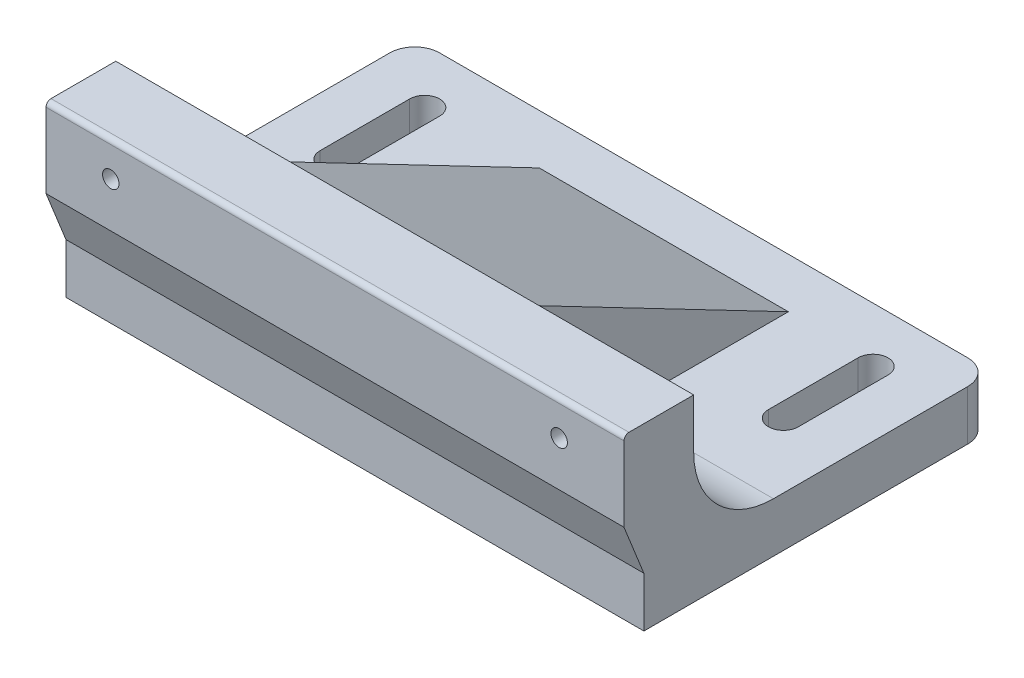
ISO-10303-21;
HEADER;
FILE_DESCRIPTION(('STEP AP214'),'2;1');
FILE_NAME('part.step','',(''),(''),'','','');
FILE_SCHEMA(('AUTOMOTIVE_DESIGN { 1 0 10303 214 1 1 1 1 }'));
ENDSEC;
DATA;
#1=APPLICATION_CONTEXT('core data for automotive mechanical design processes');
#2=APPLICATION_PROTOCOL_DEFINITION('international standard','automotive_design',2000,#1);
#3=PRODUCT_CONTEXT('',#1,'mechanical');
#4=PRODUCT('Part','Part','',(#3));
#5=PRODUCT_RELATED_PRODUCT_CATEGORY('part','',(#4));
#6=PRODUCT_DEFINITION_FORMATION('','',#4);
#7=PRODUCT_DEFINITION_CONTEXT('part definition',#1,'design');
#8=PRODUCT_DEFINITION('design','',#6,#7);
#9=PRODUCT_DEFINITION_SHAPE('','',#8);
#10=(LENGTH_UNIT() NAMED_UNIT(*) SI_UNIT(.MILLI.,.METRE.));
#11=(NAMED_UNIT(*) PLANE_ANGLE_UNIT() SI_UNIT($,.RADIAN.));
#12=(NAMED_UNIT(*) SI_UNIT($,.STERADIAN.) SOLID_ANGLE_UNIT());
#13=UNCERTAINTY_MEASURE_WITH_UNIT(LENGTH_MEASURE(1.E-05),#10,'distance_accuracy_value','');
#14=(GEOMETRIC_REPRESENTATION_CONTEXT(3) GLOBAL_UNCERTAINTY_ASSIGNED_CONTEXT((#13)) GLOBAL_UNIT_ASSIGNED_CONTEXT((#10,
#11,#12)) REPRESENTATION_CONTEXT('',''));
#15=CARTESIAN_POINT('',(0.,0.,0.));
#16=DIRECTION('',(0.,0.,1.));
#17=DIRECTION('',(1.,0.,0.));
#18=AXIS2_PLACEMENT_3D('',#15,#16,#17);
#19=CARTESIAN_POINT('',(103.,29.05,-70.));
#20=DIRECTION('',(0.,0.,1.));
#21=DIRECTION('',(1.,0.,0.));
#22=AXIS2_PLACEMENT_3D('',#19,#20,#21);
#23=CYLINDRICAL_SURFACE('',#22,1.65);
#24=CARTESIAN_POINT('',(103.,29.05,4.));
#25=DIRECTION('',(0.,0.,1.));
#26=DIRECTION('',(1.,0.,0.));
#27=AXIS2_PLACEMENT_3D('',#24,#25,#26);
#28=CIRCLE('',#27,1.65);
#29=CARTESIAN_POINT('',(104.65,29.05,4.));
#30=VERTEX_POINT('',#29);
#31=EDGE_CURVE('E404',#30,#30,#28,.T.);
#32=ORIENTED_EDGE('',*,*,#31,.T.);
#33=EDGE_LOOP('',(#32));
#34=FACE_BOUND('',#33,.T.);
#35=CARTESIAN_POINT('',(103.,29.05,-5.));
#36=DIRECTION('',(0.,0.,-1.));
#37=DIRECTION('',(-1.,0.,0.));
#38=AXIS2_PLACEMENT_3D('',#35,#36,#37);
#39=CIRCLE('',#38,1.65);
#40=CARTESIAN_POINT('',(101.35,29.05,-5.));
#41=VERTEX_POINT('',#40);
#42=EDGE_CURVE('E50',#41,#41,#39,.F.);
#43=ORIENTED_EDGE('',*,*,#42,.F.);
#44=EDGE_LOOP('',(#43));
#45=FACE_BOUND('',#44,.T.);
#46=ADVANCED_FACE('F46',(#34,#45),#23,.F.);
#47=CARTESIAN_POINT('',(13.,29.05,-70.));
#48=DIRECTION('',(0.,0.,1.));
#49=DIRECTION('',(1.,0.,0.));
#50=AXIS2_PLACEMENT_3D('',#47,#48,#49);
#51=CYLINDRICAL_SURFACE('',#50,1.65);
#52=CARTESIAN_POINT('',(13.,29.05,4.));
#53=DIRECTION('',(0.,0.,1.));
#54=DIRECTION('',(1.,0.,0.));
#55=AXIS2_PLACEMENT_3D('',#52,#53,#54);
#56=CIRCLE('',#55,1.65);
#57=CARTESIAN_POINT('',(14.65,29.05,4.));
#58=VERTEX_POINT('',#57);
#59=EDGE_CURVE('E234',#58,#58,#56,.T.);
#60=ORIENTED_EDGE('',*,*,#59,.T.);
#61=EDGE_LOOP('',(#60));
#62=FACE_BOUND('',#61,.T.);
#63=CARTESIAN_POINT('',(13.,29.05,-5.));
#64=DIRECTION('',(0.,0.,-1.));
#65=DIRECTION('',(-1.,0.,0.));
#66=AXIS2_PLACEMENT_3D('',#63,#64,#65);
#67=CIRCLE('',#66,1.65);
#68=CARTESIAN_POINT('',(11.35,29.05,-5.));
#69=VERTEX_POINT('',#68);
#70=EDGE_CURVE('E398',#69,#69,#67,.F.);
#71=ORIENTED_EDGE('',*,*,#70,.F.);
#72=EDGE_LOOP('',(#71));
#73=FACE_BOUND('',#72,.T.);
#74=ADVANCED_FACE('F445',(#62,#73),#51,.F.);
#75=CARTESIAN_POINT('',(0.,10.,0.));
#76=DIRECTION('',(0.,-1.,0.));
#77=DIRECTION('',(0.,0.,-1.));
#78=AXIS2_PLACEMENT_3D('',#75,#76,#77);
#79=PLANE('',#78);
#80=DIRECTION('',(0.,0.,1.));
#81=VECTOR('',#80,1.);
#82=CARTESIAN_POINT('',(100.,10.,-59.0000000000001));
#83=LINE('',#82,#81);
#84=CARTESIAN_POINT('',(100.,10.,-59.0000000000001));
#85=VERTEX_POINT('',#84);
#86=CARTESIAN_POINT('',(100.,10.,-41.));
#87=VERTEX_POINT('',#86);
#88=EDGE_CURVE('E327',#85,#87,#83,.T.);
#89=ORIENTED_EDGE('',*,*,#88,.F.);
#90=CARTESIAN_POINT('',(103.,10.,-59.0000000000001));
#91=DIRECTION('',(0.,1.,0.));
#92=DIRECTION('',(0.,0.,-1.));
#93=AXIS2_PLACEMENT_3D('',#90,#91,#92);
#94=CIRCLE('',#93,3.);
#95=CARTESIAN_POINT('',(106.,10.,-59.0000000000001));
#96=VERTEX_POINT('',#95);
#97=EDGE_CURVE('E294',#96,#85,#94,.T.);
#98=ORIENTED_EDGE('',*,*,#97,.F.);
#99=DIRECTION('',(0.,0.,-1.));
#100=VECTOR('',#99,1.);
#101=CARTESIAN_POINT('',(106.,10.,-59.0000000000001));
#102=LINE('',#101,#100);
#103=CARTESIAN_POINT('',(106.,10.,-41.));
#104=VERTEX_POINT('',#103);
#105=EDGE_CURVE('E320',#104,#96,#102,.T.);
#106=ORIENTED_EDGE('',*,*,#105,.F.);
#107=CARTESIAN_POINT('',(103.,10.,-41.));
#108=DIRECTION('',(0.,1.,0.));
#109=DIRECTION('',(0.,0.,-1.));
#110=AXIS2_PLACEMENT_3D('',#107,#108,#109);
#111=CIRCLE('',#110,3.);
#112=EDGE_CURVE('E323',#87,#104,#111,.T.);
#113=ORIENTED_EDGE('',*,*,#112,.F.);
#114=EDGE_LOOP('',(#89,#98,#106,#113));
#115=FACE_BOUND('',#114,.T.);
#116=DIRECTION('',(0.,0.,1.));
#117=VECTOR('',#116,1.);
#118=CARTESIAN_POINT('',(10.,10.,-59.));
#119=LINE('',#118,#117);
#120=CARTESIAN_POINT('',(10.,10.,-59.));
#121=VERTEX_POINT('',#120);
#122=CARTESIAN_POINT('',(10.,10.,-41.));
#123=VERTEX_POINT('',#122);
#124=EDGE_CURVE('E293',#121,#123,#119,.T.);
#125=ORIENTED_EDGE('',*,*,#124,.F.);
#126=CARTESIAN_POINT('',(13.,10.,-59.));
#127=DIRECTION('',(0.,1.,0.));
#128=DIRECTION('',(0.,0.,1.));
#129=AXIS2_PLACEMENT_3D('',#126,#127,#128);
#130=CIRCLE('',#129,2.99999999999998);
#131=CARTESIAN_POINT('',(16.,10.,-59.));
#132=VERTEX_POINT('',#131);
#133=EDGE_CURVE('E291',#132,#121,#130,.T.);
#134=ORIENTED_EDGE('',*,*,#133,.F.);
#135=DIRECTION('',(0.,0.,-1.));
#136=VECTOR('',#135,1.);
#137=CARTESIAN_POINT('',(16.,10.,-59.));
#138=LINE('',#137,#136);
#139=CARTESIAN_POINT('',(16.,10.,-41.));
#140=VERTEX_POINT('',#139);
#141=EDGE_CURVE('E281',#140,#132,#138,.T.);
#142=ORIENTED_EDGE('',*,*,#141,.F.);
#143=CARTESIAN_POINT('',(13.,10.,-41.));
#144=DIRECTION('',(0.,1.,0.));
#145=DIRECTION('',(0.,0.,1.));
#146=AXIS2_PLACEMENT_3D('',#143,#144,#145);
#147=CIRCLE('',#146,2.99999999999999);
#148=EDGE_CURVE('E297',#123,#140,#147,.T.);
#149=ORIENTED_EDGE('',*,*,#148,.F.);
#150=EDGE_LOOP('',(#125,#134,#142,#149));
#151=FACE_BOUND('',#150,.T.);
#152=DIRECTION('',(-1.,0.,0.));
#153=VECTOR('',#152,1.);
#154=CARTESIAN_POINT('',(0.,10.,-70.));
#155=LINE('',#154,#153);
#156=CARTESIAN_POINT('',(111.,10.,-70.));
#157=VERTEX_POINT('',#156);
#158=CARTESIAN_POINT('',(5.,10.,-70.));
#159=VERTEX_POINT('',#158);
#160=EDGE_CURVE('E351',#157,#159,#155,.T.);
#161=ORIENTED_EDGE('',*,*,#160,.T.);
#162=CARTESIAN_POINT('',(5.,10.,-65.));
#163=DIRECTION('',(0.,-1.,0.));
#164=DIRECTION('',(0.,0.,-1.));
#165=AXIS2_PLACEMENT_3D('',#162,#163,#164);
#166=CIRCLE('',#165,5.);
#167=CARTESIAN_POINT('',(0.,10.,-65.));
#168=VERTEX_POINT('',#167);
#169=EDGE_CURVE('E55',#159,#168,#166,.F.);
#170=ORIENTED_EDGE('',*,*,#169,.T.);
#171=DIRECTION('',(0.,0.,1.));
#172=VECTOR('',#171,1.);
#173=CARTESIAN_POINT('',(0.,10.,0.));
#174=LINE('',#173,#172);
#175=CARTESIAN_POINT('',(0.,10.,-26.));
#176=VERTEX_POINT('',#175);
#177=EDGE_CURVE('E346',#168,#176,#174,.T.);
#178=ORIENTED_EDGE('',*,*,#177,.T.);
#179=DIRECTION('',(1.,0.,0.));
#180=VECTOR('',#179,1.);
#181=CARTESIAN_POINT('',(0.,10.,-26.));
#182=LINE('',#181,#180);
#183=CARTESIAN_POINT('',(35.,10.,-26.));
#184=VERTEX_POINT('',#183);
#185=EDGE_CURVE('E364',#176,#184,#182,.T.);
#186=ORIENTED_EDGE('',*,*,#185,.T.);
#187=DIRECTION('',(0.,0.,-1.));
#188=VECTOR('',#187,1.);
#189=CARTESIAN_POINT('',(35.,10.,0.));
#190=LINE('',#189,#188);
#191=CARTESIAN_POINT('',(35.,10.,-60.));
#192=VERTEX_POINT('',#191);
#193=EDGE_CURVE('E254',#184,#192,#190,.T.);
#194=ORIENTED_EDGE('',*,*,#193,.T.);
#195=DIRECTION('',(-1.,0.,0.));
#196=VECTOR('',#195,1.);
#197=CARTESIAN_POINT('',(85.,10.,-60.));
#198=LINE('',#197,#196);
#199=CARTESIAN_POINT('',(85.,10.,-60.));
#200=VERTEX_POINT('',#199);
#201=EDGE_CURVE('E251',#200,#192,#198,.T.);
#202=ORIENTED_EDGE('',*,*,#201,.F.);
#203=DIRECTION('',(0.,0.,-1.));
#204=VECTOR('',#203,1.);
#205=CARTESIAN_POINT('',(85.,10.,0.));
#206=LINE('',#205,#204);
#207=CARTESIAN_POINT('',(85.,10.,-26.));
#208=VERTEX_POINT('',#207);
#209=EDGE_CURVE('E244',#208,#200,#206,.T.);
#210=ORIENTED_EDGE('',*,*,#209,.F.);
#211=CARTESIAN_POINT('',(116.,10.,-26.));
#212=VERTEX_POINT('',#211);
#213=EDGE_CURVE('E363',#208,#212,#182,.T.);
#214=ORIENTED_EDGE('',*,*,#213,.T.);
#215=DIRECTION('',(0.,0.,-1.));
#216=VECTOR('',#215,1.);
#217=CARTESIAN_POINT('',(116.,10.,0.));
#218=LINE('',#217,#216);
#219=CARTESIAN_POINT('',(116.,10.,-65.));
#220=VERTEX_POINT('',#219);
#221=EDGE_CURVE('E348',#212,#220,#218,.T.);
#222=ORIENTED_EDGE('',*,*,#221,.T.);
#223=CARTESIAN_POINT('',(111.,10.,-65.));
#224=DIRECTION('',(0.,-1.,0.));
#225=DIRECTION('',(0.,0.,-1.));
#226=AXIS2_PLACEMENT_3D('',#223,#224,#225);
#227=CIRCLE('',#226,5.);
#228=EDGE_CURVE('E396',#220,#157,#227,.F.);
#229=ORIENTED_EDGE('',*,*,#228,.T.);
#230=EDGE_LOOP('',(#161,#170,#178,#186,#194,#202,#210,#214,#222,#229));
#231=FACE_BOUND('',#230,.T.);
#232=ADVANCED_FACE('F449',(#115,#151,#231),#79,.F.);
#233=CARTESIAN_POINT('',(0.,0.,-10.));
#234=DIRECTION('',(0.,0.,-1.));
#235=DIRECTION('',(-1.,0.,0.));
#236=AXIS2_PLACEMENT_3D('',#233,#234,#235);
#237=PLANE('',#236);
#238=CARTESIAN_POINT('',(103.,29.05,-10.));
#239=DIRECTION('',(0.,0.,-1.));
#240=DIRECTION('',(-1.,0.,0.));
#241=AXIS2_PLACEMENT_3D('',#238,#239,#240);
#242=CIRCLE('',#241,2.25);
#243=CARTESIAN_POINT('',(100.75,29.05,-10.));
#244=VERTEX_POINT('',#243);
#245=EDGE_CURVE('E406',#244,#244,#242,.T.);
#246=ORIENTED_EDGE('',*,*,#245,.F.);
#247=EDGE_LOOP('',(#246));
#248=FACE_BOUND('',#247,.T.);
#249=DIRECTION('',(1.,0.,0.));
#250=VECTOR('',#249,1.);
#251=CARTESIAN_POINT('',(0.,26.,-10.));
#252=LINE('',#251,#250);
#253=CARTESIAN_POINT('',(116.,26.,-10.));
#254=VERTEX_POINT('',#253);
#255=CARTESIAN_POINT('',(85.,26.,-10.));
#256=VERTEX_POINT('',#255);
#257=EDGE_CURVE('E368',#254,#256,#252,.F.);
#258=ORIENTED_EDGE('',*,*,#257,.T.);
#259=DIRECTION('',(0.,-1.,0.));
#260=VECTOR('',#259,1.);
#261=CARTESIAN_POINT('',(85.,0.,-10.));
#262=LINE('',#261,#260);
#263=CARTESIAN_POINT('',(85.,36.05,-10.));
#264=VERTEX_POINT('',#263);
#265=EDGE_CURVE('E249',#264,#256,#262,.T.);
#266=ORIENTED_EDGE('',*,*,#265,.F.);
#267=DIRECTION('',(-1.,0.,0.));
#268=VECTOR('',#267,1.);
#269=CARTESIAN_POINT('',(0.,36.05,-9.99999999999999));
#270=LINE('',#269,#268);
#271=CARTESIAN_POINT('',(116.,36.05,-9.99999999999999));
#272=VERTEX_POINT('',#271);
#273=EDGE_CURVE('E267',#272,#264,#270,.T.);
#274=ORIENTED_EDGE('',*,*,#273,.F.);
#275=DIRECTION('',(0.,1.,0.));
#276=VECTOR('',#275,1.);
#277=CARTESIAN_POINT('',(116.,10.,-10.));
#278=LINE('',#277,#276);
#279=EDGE_CURVE('E343',#254,#272,#278,.T.);
#280=ORIENTED_EDGE('',*,*,#279,.F.);
#281=EDGE_LOOP('',(#258,#266,#274,#280));
#282=FACE_BOUND('',#281,.T.);
#283=ADVANCED_FACE('F635',(#248,#282),#237,.T.);
#284=CARTESIAN_POINT('',(0.,26.,-26.));
#285=DIRECTION('',(1.,0.,0.));
#286=DIRECTION('',(0.,0.,-1.));
#287=AXIS2_PLACEMENT_3D('',#284,#285,#286);
#288=CYLINDRICAL_SURFACE('',#287,16.);
#289=CARTESIAN_POINT('',(85.,26.,-26.));
#290=DIRECTION('',(-1.,0.,0.));
#291=DIRECTION('',(0.,0.,1.));
#292=AXIS2_PLACEMENT_3D('',#289,#290,#291);
#293=CIRCLE('',#292,16.);
#294=EDGE_CURVE('E247',#256,#208,#293,.F.);
#295=ORIENTED_EDGE('',*,*,#294,.F.);
#296=ORIENTED_EDGE('',*,*,#257,.F.);
#297=CARTESIAN_POINT('',(116.,26.,-26.));
#298=DIRECTION('',(-1.,0.,0.));
#299=DIRECTION('',(0.,0.,1.));
#300=AXIS2_PLACEMENT_3D('',#297,#298,#299);
#301=CIRCLE('',#300,16.);
#302=EDGE_CURVE('E371',#212,#254,#301,.T.);
#303=ORIENTED_EDGE('',*,*,#302,.F.);
#304=ORIENTED_EDGE('',*,*,#213,.F.);
#305=EDGE_LOOP('',(#295,#296,#303,#304));
#306=FACE_BOUND('',#305,.T.);
#307=ADVANCED_FACE('F596',(#306),#288,.F.);
#308=CARTESIAN_POINT('',(0.,10.,0.));
#309=DIRECTION('',(1.,0.,0.));
#310=DIRECTION('',(0.,0.,-1.));
#311=AXIS2_PLACEMENT_3D('',#308,#309,#310);
#312=PLANE('',#311);
#313=ORIENTED_EDGE('',*,*,#177,.F.);
#314=DIRECTION('',(0.,-1.,0.));
#315=VECTOR('',#314,1.);
#316=CARTESIAN_POINT('',(0.,10.,-65.));
#317=LINE('',#316,#315);
#318=CARTESIAN_POINT('',(0.,0.,-65.));
#319=VERTEX_POINT('',#318);
#320=EDGE_CURVE('E385',#168,#319,#317,.T.);
#321=ORIENTED_EDGE('',*,*,#320,.T.);
#322=DIRECTION('',(0.,0.,1.));
#323=VECTOR('',#322,1.);
#324=CARTESIAN_POINT('',(0.,0.,0.));
#325=LINE('',#324,#323);
#326=CARTESIAN_POINT('',(0.,0.,0.));
#327=VERTEX_POINT('',#326);
#328=EDGE_CURVE('E345',#319,#327,#325,.T.);
#329=ORIENTED_EDGE('',*,*,#328,.T.);
#330=DIRECTION('',(0.,-1.,0.));
#331=VECTOR('',#330,1.);
#332=CARTESIAN_POINT('',(0.,10.,0.));
#333=LINE('',#332,#331);
#334=CARTESIAN_POINT('',(0.,10.0500000000001,0.));
#335=VERTEX_POINT('',#334);
#336=EDGE_CURVE('E217',#335,#327,#333,.T.);
#337=ORIENTED_EDGE('',*,*,#336,.F.);
#338=DIRECTION('',(0.,0.928476690885258,0.371390676354106));
#339=VECTOR('',#338,1.);
#340=CARTESIAN_POINT('',(0.,10.0068965517241,-0.0172413793103699));
#341=LINE('',#340,#339);
#342=CARTESIAN_POINT('',(0.,20.05,4.));
#343=VERTEX_POINT('',#342);
#344=EDGE_CURVE('E211',#335,#343,#341,.T.);
#345=ORIENTED_EDGE('',*,*,#344,.T.);
#346=DIRECTION('',(0.,1.,0.));
#347=VECTOR('',#346,1.);
#348=CARTESIAN_POINT('',(0.,36.05,4.));
#349=LINE('',#348,#347);
#350=CARTESIAN_POINT('',(0.,35.05,4.));
#351=VERTEX_POINT('',#350);
#352=EDGE_CURVE('E215',#343,#351,#349,.T.);
#353=ORIENTED_EDGE('',*,*,#352,.T.);
#354=CARTESIAN_POINT('',(0.,35.05,3.));
#355=DIRECTION('',(1.,0.,0.));
#356=DIRECTION('',(0.,0.,-1.));
#357=AXIS2_PLACEMENT_3D('',#354,#355,#356);
#358=CIRCLE('',#357,1.);
#359=CARTESIAN_POINT('',(0.,36.05,3.));
#360=VERTEX_POINT('',#359);
#361=EDGE_CURVE('E379',#351,#360,#358,.F.);
#362=ORIENTED_EDGE('',*,*,#361,.T.);
#363=DIRECTION('',(0.,0.,1.));
#364=VECTOR('',#363,1.);
#365=CARTESIAN_POINT('',(0.,36.05,-127.239071985409));
#366=LINE('',#365,#364);
#367=CARTESIAN_POINT('',(0.,36.05,-9.99999999999999));
#368=VERTEX_POINT('',#367);
#369=EDGE_CURVE('E270',#368,#360,#366,.T.);
#370=ORIENTED_EDGE('',*,*,#369,.F.);
#371=DIRECTION('',(0.,-1.,0.));
#372=VECTOR('',#371,1.);
#373=CARTESIAN_POINT('',(0.,10.,-10.));
#374=LINE('',#373,#372);
#375=CARTESIAN_POINT('',(0.,26.,-10.));
#376=VERTEX_POINT('',#375);
#377=EDGE_CURVE('E304',#368,#376,#374,.T.);
#378=ORIENTED_EDGE('',*,*,#377,.T.);
#379=CARTESIAN_POINT('',(0.,26.,-26.));
#380=DIRECTION('',(1.,0.,0.));
#381=DIRECTION('',(0.,0.,-1.));
#382=AXIS2_PLACEMENT_3D('',#379,#380,#381);
#383=CIRCLE('',#382,16.);
#384=EDGE_CURVE('E373',#376,#176,#383,.T.);
#385=ORIENTED_EDGE('',*,*,#384,.T.);
#386=EDGE_LOOP('',(#313,#321,#329,#337,#345,#353,#362,#370,#378,#385));
#387=FACE_BOUND('',#386,.T.);
#388=ADVANCED_FACE('F214',(#387),#312,.F.);
#389=CARTESIAN_POINT('',(0.,10.,0.));
#390=DIRECTION('',(0.,0.,-1.));
#391=DIRECTION('',(-1.,0.,0.));
#392=AXIS2_PLACEMENT_3D('',#389,#390,#391);
#393=PLANE('',#392);
#394=DIRECTION('',(0.,-1.,0.));
#395=VECTOR('',#394,1.);
#396=CARTESIAN_POINT('',(116.,10.,0.));
#397=LINE('',#396,#395);
#398=CARTESIAN_POINT('',(116.,10.0500000000001,0.));
#399=VERTEX_POINT('',#398);
#400=CARTESIAN_POINT('',(116.,0.,0.));
#401=VERTEX_POINT('',#400);
#402=EDGE_CURVE('E353',#399,#401,#397,.T.);
#403=ORIENTED_EDGE('',*,*,#402,.F.);
#404=DIRECTION('',(-1.,0.,0.));
#405=VECTOR('',#404,1.);
#406=CARTESIAN_POINT('',(0.,10.0500000000001,0.));
#407=LINE('',#406,#405);
#408=EDGE_CURVE('E223',#399,#335,#407,.T.);
#409=ORIENTED_EDGE('',*,*,#408,.T.);
#410=ORIENTED_EDGE('',*,*,#336,.T.);
#411=DIRECTION('',(1.,0.,0.));
#412=VECTOR('',#411,1.);
#413=CARTESIAN_POINT('',(0.,0.,0.));
#414=LINE('',#413,#412);
#415=EDGE_CURVE('E355',#327,#401,#414,.T.);
#416=ORIENTED_EDGE('',*,*,#415,.T.);
#417=EDGE_LOOP('',(#403,#409,#410,#416));
#418=FACE_BOUND('',#417,.T.);
#419=ADVANCED_FACE('F582',(#418),#393,.F.);
#420=CARTESIAN_POINT('',(116.,10.,0.));
#421=DIRECTION('',(-1.,0.,0.));
#422=DIRECTION('',(0.,0.,1.));
#423=AXIS2_PLACEMENT_3D('',#420,#421,#422);
#424=PLANE('',#423);
#425=DIRECTION('',(0.,0.,-1.));
#426=VECTOR('',#425,1.);
#427=CARTESIAN_POINT('',(116.,0.,0.));
#428=LINE('',#427,#426);
#429=CARTESIAN_POINT('',(116.,0.,-65.));
#430=VERTEX_POINT('',#429);
#431=EDGE_CURVE('E358',#401,#430,#428,.T.);
#432=ORIENTED_EDGE('',*,*,#431,.T.);
#433=DIRECTION('',(0.,-1.,0.));
#434=VECTOR('',#433,1.);
#435=CARTESIAN_POINT('',(116.,10.,-65.));
#436=LINE('',#435,#434);
#437=EDGE_CURVE('E11',#430,#220,#436,.F.);
#438=ORIENTED_EDGE('',*,*,#437,.T.);
#439=ORIENTED_EDGE('',*,*,#221,.F.);
#440=ORIENTED_EDGE('',*,*,#302,.T.);
#441=ORIENTED_EDGE('',*,*,#279,.T.);
#442=DIRECTION('',(0.,0.,1.));
#443=VECTOR('',#442,1.);
#444=CARTESIAN_POINT('',(116.,36.05,-127.239071985409));
#445=LINE('',#444,#443);
#446=CARTESIAN_POINT('',(116.,36.05,3.));
#447=VERTEX_POINT('',#446);
#448=EDGE_CURVE('E265',#272,#447,#445,.T.);
#449=ORIENTED_EDGE('',*,*,#448,.T.);
#450=CARTESIAN_POINT('',(116.,35.05,3.));
#451=DIRECTION('',(-1.,0.,0.));
#452=DIRECTION('',(0.,0.,1.));
#453=AXIS2_PLACEMENT_3D('',#450,#451,#452);
#454=CIRCLE('',#453,1.);
#455=CARTESIAN_POINT('',(116.,35.05,4.));
#456=VERTEX_POINT('',#455);
#457=EDGE_CURVE('E383',#447,#456,#454,.F.);
#458=ORIENTED_EDGE('',*,*,#457,.T.);
#459=DIRECTION('',(0.,-1.,0.));
#460=VECTOR('',#459,1.);
#461=CARTESIAN_POINT('',(116.,36.05,4.));
#462=LINE('',#461,#460);
#463=CARTESIAN_POINT('',(116.,20.05,4.));
#464=VERTEX_POINT('',#463);
#465=EDGE_CURVE('E237',#456,#464,#462,.T.);
#466=ORIENTED_EDGE('',*,*,#465,.T.);
#467=DIRECTION('',(0.,-0.928476690885258,-0.371390676354106));
#468=VECTOR('',#467,1.);
#469=CARTESIAN_POINT('',(116.,10.0068965517241,-0.0172413793103699));
#470=LINE('',#469,#468);
#471=EDGE_CURVE('E222',#464,#399,#470,.T.);
#472=ORIENTED_EDGE('',*,*,#471,.T.);
#473=ORIENTED_EDGE('',*,*,#402,.T.);
#474=EDGE_LOOP('',(#432,#438,#439,#440,#441,#449,#458,#466,#472,#473));
#475=FACE_BOUND('',#474,.T.);
#476=ADVANCED_FACE('F574',(#475),#424,.F.);
#477=CARTESIAN_POINT('',(0.,10.,-70.));
#478=DIRECTION('',(0.,0.,1.));
#479=DIRECTION('',(1.,0.,0.));
#480=AXIS2_PLACEMENT_3D('',#477,#478,#479);
#481=PLANE('',#480);
#482=DIRECTION('',(-1.,0.,0.));
#483=VECTOR('',#482,1.);
#484=CARTESIAN_POINT('',(0.,0.,-70.));
#485=LINE('',#484,#483);
#486=CARTESIAN_POINT('',(111.,0.,-70.));
#487=VERTEX_POINT('',#486);
#488=CARTESIAN_POINT('',(5.,0.,-70.));
#489=VERTEX_POINT('',#488);
#490=EDGE_CURVE('E349',#487,#489,#485,.T.);
#491=ORIENTED_EDGE('',*,*,#490,.T.);
#492=DIRECTION('',(0.,-1.,0.));
#493=VECTOR('',#492,1.);
#494=CARTESIAN_POINT('',(5.,10.,-70.));
#495=LINE('',#494,#493);
#496=EDGE_CURVE('E69',#489,#159,#495,.F.);
#497=ORIENTED_EDGE('',*,*,#496,.T.);
#498=ORIENTED_EDGE('',*,*,#160,.F.);
#499=DIRECTION('',(0.,-1.,0.));
#500=VECTOR('',#499,1.);
#501=CARTESIAN_POINT('',(111.,10.,-70.));
#502=LINE('',#501,#500);
#503=EDGE_CURVE('E392',#157,#487,#502,.T.);
#504=ORIENTED_EDGE('',*,*,#503,.T.);
#505=EDGE_LOOP('',(#491,#497,#498,#504));
#506=FACE_BOUND('',#505,.T.);
#507=ADVANCED_FACE('F581',(#506),#481,.F.);
#508=CARTESIAN_POINT('',(0.,0.,0.));
#509=DIRECTION('',(0.,-1.,0.));
#510=DIRECTION('',(0.,0.,-1.));
#511=AXIS2_PLACEMENT_3D('',#508,#509,#510);
#512=PLANE('',#511);
#513=CARTESIAN_POINT('',(13.,0.,-59.));
#514=DIRECTION('',(0.,1.,0.));
#515=DIRECTION('',(0.,0.,1.));
#516=AXIS2_PLACEMENT_3D('',#513,#514,#515);
#517=CIRCLE('',#516,2.99999999999998);
#518=CARTESIAN_POINT('',(16.,0.,-59.));
#519=VERTEX_POINT('',#518);
#520=CARTESIAN_POINT('',(10.,0.,-59.));
#521=VERTEX_POINT('',#520);
#522=EDGE_CURVE('E277',#519,#521,#517,.T.);
#523=ORIENTED_EDGE('',*,*,#522,.T.);
#524=DIRECTION('',(0.,0.,1.));
#525=VECTOR('',#524,1.);
#526=CARTESIAN_POINT('',(10.,0.,-59.));
#527=LINE('',#526,#525);
#528=CARTESIAN_POINT('',(10.,0.,-41.));
#529=VERTEX_POINT('',#528);
#530=EDGE_CURVE('E280',#521,#529,#527,.T.);
#531=ORIENTED_EDGE('',*,*,#530,.T.);
#532=CARTESIAN_POINT('',(13.,0.,-41.));
#533=DIRECTION('',(0.,1.,0.));
#534=DIRECTION('',(0.,0.,1.));
#535=AXIS2_PLACEMENT_3D('',#532,#533,#534);
#536=CIRCLE('',#535,2.99999999999999);
#537=CARTESIAN_POINT('',(16.,0.,-41.));
#538=VERTEX_POINT('',#537);
#539=EDGE_CURVE('E284',#529,#538,#536,.T.);
#540=ORIENTED_EDGE('',*,*,#539,.T.);
#541=DIRECTION('',(0.,0.,-1.));
#542=VECTOR('',#541,1.);
#543=CARTESIAN_POINT('',(16.,0.,-59.));
#544=LINE('',#543,#542);
#545=EDGE_CURVE('E287',#538,#519,#544,.T.);
#546=ORIENTED_EDGE('',*,*,#545,.T.);
#547=EDGE_LOOP('',(#523,#531,#540,#546));
#548=FACE_BOUND('',#547,.T.);
#549=CARTESIAN_POINT('',(103.,0.,-59.0000000000001));
#550=DIRECTION('',(0.,1.,0.));
#551=DIRECTION('',(0.,0.,-1.));
#552=AXIS2_PLACEMENT_3D('',#549,#550,#551);
#553=CIRCLE('',#552,3.);
#554=CARTESIAN_POINT('',(106.,0.,-59.0000000000001));
#555=VERTEX_POINT('',#554);
#556=CARTESIAN_POINT('',(100.,0.,-59.0000000000001));
#557=VERTEX_POINT('',#556);
#558=EDGE_CURVE('E324',#555,#557,#553,.T.);
#559=ORIENTED_EDGE('',*,*,#558,.T.);
#560=DIRECTION('',(0.,0.,1.));
#561=VECTOR('',#560,1.);
#562=CARTESIAN_POINT('',(100.,0.,-59.0000000000001));
#563=LINE('',#562,#561);
#564=CARTESIAN_POINT('',(100.,0.,-41.));
#565=VERTEX_POINT('',#564);
#566=EDGE_CURVE('E336',#557,#565,#563,.T.);
#567=ORIENTED_EDGE('',*,*,#566,.T.);
#568=CARTESIAN_POINT('',(103.,0.,-41.));
#569=DIRECTION('',(0.,1.,0.));
#570=DIRECTION('',(0.,0.,-1.));
#571=AXIS2_PLACEMENT_3D('',#568,#569,#570);
#572=CIRCLE('',#571,3.);
#573=CARTESIAN_POINT('',(106.,0.,-41.));
#574=VERTEX_POINT('',#573);
#575=EDGE_CURVE('E333',#565,#574,#572,.T.);
#576=ORIENTED_EDGE('',*,*,#575,.T.);
#577=DIRECTION('',(0.,0.,-1.));
#578=VECTOR('',#577,1.);
#579=CARTESIAN_POINT('',(106.,0.,-59.0000000000001));
#580=LINE('',#579,#578);
#581=EDGE_CURVE('E314',#574,#555,#580,.T.);
#582=ORIENTED_EDGE('',*,*,#581,.T.);
#583=EDGE_LOOP('',(#559,#567,#576,#582));
#584=FACE_BOUND('',#583,.T.);
#585=ORIENTED_EDGE('',*,*,#328,.F.);
#586=CARTESIAN_POINT('',(5.,0.,-65.));
#587=DIRECTION('',(0.,-1.,0.));
#588=DIRECTION('',(0.,0.,-1.));
#589=AXIS2_PLACEMENT_3D('',#586,#587,#588);
#590=CIRCLE('',#589,5.);
#591=EDGE_CURVE('E390',#319,#489,#590,.T.);
#592=ORIENTED_EDGE('',*,*,#591,.T.);
#593=ORIENTED_EDGE('',*,*,#490,.F.);
#594=CARTESIAN_POINT('',(111.,0.,-65.));
#595=DIRECTION('',(0.,-1.,0.));
#596=DIRECTION('',(0.,0.,-1.));
#597=AXIS2_PLACEMENT_3D('',#594,#595,#596);
#598=CIRCLE('',#597,5.);
#599=EDGE_CURVE('E388',#487,#430,#598,.T.);
#600=ORIENTED_EDGE('',*,*,#599,.T.);
#601=ORIENTED_EDGE('',*,*,#431,.F.);
#602=ORIENTED_EDGE('',*,*,#415,.F.);
#603=EDGE_LOOP('',(#585,#592,#593,#600,#601,#602));
#604=FACE_BOUND('',#603,.T.);
#605=ADVANCED_FACE('F671',(#548,#584,#604),#512,.T.);
#606=CARTESIAN_POINT('',(13.,29.05,-10.));
#607=DIRECTION('',(0.,0.,-1.));
#608=DIRECTION('',(-1.,0.,0.));
#609=AXIS2_PLACEMENT_3D('',#606,#607,#608);
#610=CIRCLE('',#609,2.25);
#611=CARTESIAN_POINT('',(10.75,29.05,-10.));
#612=VERTEX_POINT('',#611);
#613=EDGE_CURVE('E411',#612,#612,#610,.T.);
#614=ORIENTED_EDGE('',*,*,#613,.F.);
#615=EDGE_LOOP('',(#614));
#616=FACE_BOUND('',#615,.T.);
#617=DIRECTION('',(0.,-1.,0.));
#618=VECTOR('',#617,1.);
#619=CARTESIAN_POINT('',(35.,0.,-10.));
#620=LINE('',#619,#618);
#621=CARTESIAN_POINT('',(35.,36.05,-10.));
#622=VERTEX_POINT('',#621);
#623=CARTESIAN_POINT('',(35.,26.,-10.));
#624=VERTEX_POINT('',#623);
#625=EDGE_CURVE('E245',#622,#624,#620,.T.);
#626=ORIENTED_EDGE('',*,*,#625,.T.);
#627=EDGE_CURVE('E367',#624,#376,#252,.F.);
#628=ORIENTED_EDGE('',*,*,#627,.T.);
#629=ORIENTED_EDGE('',*,*,#377,.F.);
#630=EDGE_CURVE('E271',#622,#368,#270,.T.);
#631=ORIENTED_EDGE('',*,*,#630,.F.);
#632=EDGE_LOOP('',(#626,#628,#629,#631));
#633=FACE_BOUND('',#632,.T.);
#634=ADVANCED_FACE('F647',(#616,#633),#237,.T.);
#635=CARTESIAN_POINT('',(103.,0.,-59.0000000000001));
#636=DIRECTION('',(0.,1.,0.));
#637=DIRECTION('',(0.,0.,1.));
#638=AXIS2_PLACEMENT_3D('',#635,#636,#637);
#639=CYLINDRICAL_SURFACE('',#638,3.);
#640=ORIENTED_EDGE('',*,*,#97,.T.);
#641=DIRECTION('',(0.,1.,0.));
#642=VECTOR('',#641,1.);
#643=CARTESIAN_POINT('',(100.,0.,-59.0000000000001));
#644=LINE('',#643,#642);
#645=EDGE_CURVE('E311',#557,#85,#644,.T.);
#646=ORIENTED_EDGE('',*,*,#645,.F.);
#647=ORIENTED_EDGE('',*,*,#558,.F.);
#648=DIRECTION('',(0.,1.,0.));
#649=VECTOR('',#648,1.);
#650=CARTESIAN_POINT('',(106.,0.,-59.0000000000001));
#651=LINE('',#650,#649);
#652=EDGE_CURVE('E274',#555,#96,#651,.T.);
#653=ORIENTED_EDGE('',*,*,#652,.T.);
#654=EDGE_LOOP('',(#640,#646,#647,#653));
#655=FACE_BOUND('',#654,.T.);
#656=ADVANCED_FACE('F683',(#655),#639,.F.);
#657=CARTESIAN_POINT('',(106.,0.,-59.0000000000001));
#658=DIRECTION('',(1.,0.,0.));
#659=DIRECTION('',(0.,0.,-1.));
#660=AXIS2_PLACEMENT_3D('',#657,#658,#659);
#661=PLANE('',#660);
#662=ORIENTED_EDGE('',*,*,#105,.T.);
#663=ORIENTED_EDGE('',*,*,#652,.F.);
#664=ORIENTED_EDGE('',*,*,#581,.F.);
#665=DIRECTION('',(0.,1.,0.));
#666=VECTOR('',#665,1.);
#667=CARTESIAN_POINT('',(106.,0.,-41.));
#668=LINE('',#667,#666);
#669=EDGE_CURVE('E317',#574,#104,#668,.T.);
#670=ORIENTED_EDGE('',*,*,#669,.T.);
#671=EDGE_LOOP('',(#662,#663,#664,#670));
#672=FACE_BOUND('',#671,.T.);
#673=ADVANCED_FACE('F692',(#672),#661,.F.);
#674=CARTESIAN_POINT('',(103.,0.,-41.));
#675=DIRECTION('',(0.,1.,0.));
#676=DIRECTION('',(0.,0.,1.));
#677=AXIS2_PLACEMENT_3D('',#674,#675,#676);
#678=CYLINDRICAL_SURFACE('',#677,3.);
#679=ORIENTED_EDGE('',*,*,#112,.T.);
#680=ORIENTED_EDGE('',*,*,#669,.F.);
#681=ORIENTED_EDGE('',*,*,#575,.F.);
#682=DIRECTION('',(0.,1.,0.));
#683=VECTOR('',#682,1.);
#684=CARTESIAN_POINT('',(100.,0.,-41.));
#685=LINE('',#684,#683);
#686=EDGE_CURVE('E315',#565,#87,#685,.T.);
#687=ORIENTED_EDGE('',*,*,#686,.T.);
#688=EDGE_LOOP('',(#679,#680,#681,#687));
#689=FACE_BOUND('',#688,.T.);
#690=ADVANCED_FACE('F700',(#689),#678,.F.);
#691=CARTESIAN_POINT('',(100.,0.,-59.0000000000001));
#692=DIRECTION('',(-1.,0.,0.));
#693=DIRECTION('',(0.,0.,1.));
#694=AXIS2_PLACEMENT_3D('',#691,#692,#693);
#695=PLANE('',#694);
#696=ORIENTED_EDGE('',*,*,#88,.T.);
#697=ORIENTED_EDGE('',*,*,#686,.F.);
#698=ORIENTED_EDGE('',*,*,#566,.F.);
#699=ORIENTED_EDGE('',*,*,#645,.T.);
#700=EDGE_LOOP('',(#696,#697,#698,#699));
#701=FACE_BOUND('',#700,.T.);
#702=ADVANCED_FACE('F708',(#701),#695,.F.);
#703=CARTESIAN_POINT('',(13.,0.,-59.));
#704=DIRECTION('',(0.,1.,0.));
#705=DIRECTION('',(0.,0.,1.));
#706=AXIS2_PLACEMENT_3D('',#703,#704,#705);
#707=CYLINDRICAL_SURFACE('',#706,2.99999999999998);
#708=ORIENTED_EDGE('',*,*,#133,.T.);
#709=DIRECTION('',(0.,1.,0.));
#710=VECTOR('',#709,1.);
#711=CARTESIAN_POINT('',(10.,0.,-59.));
#712=LINE('',#711,#710);
#713=EDGE_CURVE('E290',#521,#121,#712,.T.);
#714=ORIENTED_EDGE('',*,*,#713,.F.);
#715=ORIENTED_EDGE('',*,*,#522,.F.);
#716=DIRECTION('',(0.,1.,0.));
#717=VECTOR('',#716,1.);
#718=CARTESIAN_POINT('',(16.,0.,-59.));
#719=LINE('',#718,#717);
#720=EDGE_CURVE('E302',#519,#132,#719,.T.);
#721=ORIENTED_EDGE('',*,*,#720,.T.);
#722=EDGE_LOOP('',(#708,#714,#715,#721));
#723=FACE_BOUND('',#722,.T.);
#724=ADVANCED_FACE('F716',(#723),#707,.F.);
#725=CARTESIAN_POINT('',(16.,0.,-59.));
#726=DIRECTION('',(1.,0.,0.));
#727=DIRECTION('',(0.,0.,-1.));
#728=AXIS2_PLACEMENT_3D('',#725,#726,#727);
#729=PLANE('',#728);
#730=ORIENTED_EDGE('',*,*,#141,.T.);
#731=ORIENTED_EDGE('',*,*,#720,.F.);
#732=ORIENTED_EDGE('',*,*,#545,.F.);
#733=DIRECTION('',(0.,1.,0.));
#734=VECTOR('',#733,1.);
#735=CARTESIAN_POINT('',(16.,0.,-41.));
#736=LINE('',#735,#734);
#737=EDGE_CURVE('E305',#538,#140,#736,.T.);
#738=ORIENTED_EDGE('',*,*,#737,.T.);
#739=EDGE_LOOP('',(#730,#731,#732,#738));
#740=FACE_BOUND('',#739,.T.);
#741=ADVANCED_FACE('F724',(#740),#729,.F.);
#742=CARTESIAN_POINT('',(13.,0.,-41.));
#743=DIRECTION('',(0.,1.,0.));
#744=DIRECTION('',(0.,0.,1.));
#745=AXIS2_PLACEMENT_3D('',#742,#743,#744);
#746=CYLINDRICAL_SURFACE('',#745,2.99999999999999);
#747=ORIENTED_EDGE('',*,*,#148,.T.);
#748=ORIENTED_EDGE('',*,*,#737,.F.);
#749=ORIENTED_EDGE('',*,*,#539,.F.);
#750=DIRECTION('',(0.,1.,0.));
#751=VECTOR('',#750,1.);
#752=CARTESIAN_POINT('',(10.,0.,-41.));
#753=LINE('',#752,#751);
#754=EDGE_CURVE('E307',#529,#123,#753,.T.);
#755=ORIENTED_EDGE('',*,*,#754,.T.);
#756=EDGE_LOOP('',(#747,#748,#749,#755));
#757=FACE_BOUND('',#756,.T.);
#758=ADVANCED_FACE('F732',(#757),#746,.F.);
#759=CARTESIAN_POINT('',(10.,0.,-59.));
#760=DIRECTION('',(-1.,0.,0.));
#761=DIRECTION('',(0.,0.,1.));
#762=AXIS2_PLACEMENT_3D('',#759,#760,#761);
#763=PLANE('',#762);
#764=ORIENTED_EDGE('',*,*,#124,.T.);
#765=ORIENTED_EDGE('',*,*,#754,.F.);
#766=ORIENTED_EDGE('',*,*,#530,.F.);
#767=ORIENTED_EDGE('',*,*,#713,.T.);
#768=EDGE_LOOP('',(#764,#765,#766,#767));
#769=FACE_BOUND('',#768,.T.);
#770=ADVANCED_FACE('F565',(#769),#763,.F.);
#771=CARTESIAN_POINT('',(0.,36.05,-127.239071985409));
#772=DIRECTION('',(0.,1.,0.));
#773=DIRECTION('',(0.,0.,1.));
#774=AXIS2_PLACEMENT_3D('',#771,#772,#773);
#775=PLANE('',#774);
#776=ORIENTED_EDGE('',*,*,#369,.T.);
#777=DIRECTION('',(-1.,0.,0.));
#778=VECTOR('',#777,1.);
#779=CARTESIAN_POINT('',(0.,36.05,3.));
#780=LINE('',#779,#778);
#781=EDGE_CURVE('E381',#360,#447,#780,.F.);
#782=ORIENTED_EDGE('',*,*,#781,.T.);
#783=ORIENTED_EDGE('',*,*,#448,.F.);
#784=ORIENTED_EDGE('',*,*,#273,.T.);
#785=DIRECTION('',(-1.,0.,0.));
#786=VECTOR('',#785,1.);
#787=CARTESIAN_POINT('',(85.,36.05,-10.));
#788=LINE('',#787,#786);
#789=EDGE_CURVE('E262',#264,#622,#788,.T.);
#790=ORIENTED_EDGE('',*,*,#789,.T.);
#791=ORIENTED_EDGE('',*,*,#630,.T.);
#792=EDGE_LOOP('',(#776,#782,#783,#784,#790,#791));
#793=FACE_BOUND('',#792,.T.);
#794=ADVANCED_FACE('F558',(#793),#775,.T.);
#795=ORIENTED_EDGE('',*,*,#627,.F.);
#796=CARTESIAN_POINT('',(35.,26.,-26.));
#797=DIRECTION('',(-1.,0.,0.));
#798=DIRECTION('',(0.,0.,1.));
#799=AXIS2_PLACEMENT_3D('',#796,#797,#798);
#800=CIRCLE('',#799,16.);
#801=EDGE_CURVE('E257',#624,#184,#800,.F.);
#802=ORIENTED_EDGE('',*,*,#801,.T.);
#803=ORIENTED_EDGE('',*,*,#185,.F.);
#804=ORIENTED_EDGE('',*,*,#384,.F.);
#805=EDGE_LOOP('',(#795,#802,#803,#804));
#806=FACE_BOUND('',#805,.T.);
#807=ADVANCED_FACE('F564',(#806),#288,.F.);
#808=CARTESIAN_POINT('',(85.,32.451368172019,-16.9071628176219));
#809=DIRECTION('',(0.,-0.886853519801642,0.462050683816655));
#810=DIRECTION('',(0.,-0.462050683816655,-0.886853519801642));
#811=AXIS2_PLACEMENT_3D('',#808,#809,#810);
#812=PLANE('',#811);
#813=DIRECTION('',(0.,0.462050683816655,0.886853519801642));
#814=VECTOR('',#813,1.);
#815=CARTESIAN_POINT('',(35.,32.451368172019,-16.9071628176219));
#816=LINE('',#815,#814);
#817=EDGE_CURVE('E239',#192,#622,#816,.T.);
#818=ORIENTED_EDGE('',*,*,#817,.T.);
#819=ORIENTED_EDGE('',*,*,#789,.F.);
#820=DIRECTION('',(0.,0.462050683816655,0.886853519801642));
#821=VECTOR('',#820,1.);
#822=CARTESIAN_POINT('',(85.,32.451368172019,-16.9071628176219));
#823=LINE('',#822,#821);
#824=EDGE_CURVE('E242',#200,#264,#823,.T.);
#825=ORIENTED_EDGE('',*,*,#824,.F.);
#826=ORIENTED_EDGE('',*,*,#201,.T.);
#827=EDGE_LOOP('',(#818,#819,#825,#826));
#828=FACE_BOUND('',#827,.T.);
#829=ADVANCED_FACE('F615',(#828),#812,.F.);
#830=CARTESIAN_POINT('',(85.,0.,0.));
#831=DIRECTION('',(-1.,0.,0.));
#832=DIRECTION('',(0.,0.,1.));
#833=AXIS2_PLACEMENT_3D('',#830,#831,#832);
#834=PLANE('',#833);
#835=ORIENTED_EDGE('',*,*,#824,.T.);
#836=ORIENTED_EDGE('',*,*,#265,.T.);
#837=ORIENTED_EDGE('',*,*,#294,.T.);
#838=ORIENTED_EDGE('',*,*,#209,.T.);
#839=EDGE_LOOP('',(#835,#836,#837,#838));
#840=FACE_BOUND('',#839,.T.);
#841=ADVANCED_FACE('F438',(#840),#834,.F.);
#842=CARTESIAN_POINT('',(35.,0.,0.));
#843=DIRECTION('',(-1.,0.,0.));
#844=DIRECTION('',(0.,0.,1.));
#845=AXIS2_PLACEMENT_3D('',#842,#843,#844);
#846=PLANE('',#845);
#847=ORIENTED_EDGE('',*,*,#817,.F.);
#848=ORIENTED_EDGE('',*,*,#193,.F.);
#849=ORIENTED_EDGE('',*,*,#801,.F.);
#850=ORIENTED_EDGE('',*,*,#625,.F.);
#851=EDGE_LOOP('',(#847,#848,#849,#850));
#852=FACE_BOUND('',#851,.T.);
#853=ADVANCED_FACE('F427',(#852),#846,.T.);
#854=CARTESIAN_POINT('',(132.492422502471,36.05,4.));
#855=DIRECTION('',(0.,0.,1.));
#856=DIRECTION('',(0.,-1.,0.));
#857=AXIS2_PLACEMENT_3D('',#854,#855,#856);
#858=PLANE('',#857);
#859=ORIENTED_EDGE('',*,*,#59,.F.);
#860=EDGE_LOOP('',(#859));
#861=FACE_BOUND('',#860,.T.);
#862=ORIENTED_EDGE('',*,*,#31,.F.);
#863=EDGE_LOOP('',(#862));
#864=FACE_BOUND('',#863,.T.);
#865=ORIENTED_EDGE('',*,*,#465,.F.);
#866=DIRECTION('',(-1.,0.,0.));
#867=VECTOR('',#866,1.);
#868=CARTESIAN_POINT('',(132.492422502471,35.05,4.));
#869=LINE('',#868,#867);
#870=EDGE_CURVE('E233',#456,#351,#869,.T.);
#871=ORIENTED_EDGE('',*,*,#870,.T.);
#872=ORIENTED_EDGE('',*,*,#352,.F.);
#873=DIRECTION('',(-1.,0.,0.));
#874=VECTOR('',#873,1.);
#875=CARTESIAN_POINT('',(132.492422502471,20.05,4.));
#876=LINE('',#875,#874);
#877=EDGE_CURVE('E230',#464,#343,#876,.T.);
#878=ORIENTED_EDGE('',*,*,#877,.F.);
#879=EDGE_LOOP('',(#865,#871,#872,#878));
#880=FACE_BOUND('',#879,.T.);
#881=ADVANCED_FACE('F229',(#861,#864,#880),#858,.T.);
#882=CARTESIAN_POINT('',(0.,10.0500000000001,0.));
#883=DIRECTION('',(0.,0.371390676354106,-0.928476690885258));
#884=DIRECTION('',(-1.,0.,0.));
#885=AXIS2_PLACEMENT_3D('',#882,#883,#884);
#886=PLANE('',#885);
#887=ORIENTED_EDGE('',*,*,#471,.F.);
#888=ORIENTED_EDGE('',*,*,#877,.T.);
#889=ORIENTED_EDGE('',*,*,#344,.F.);
#890=ORIENTED_EDGE('',*,*,#408,.F.);
#891=EDGE_LOOP('',(#887,#888,#889,#890));
#892=FACE_BOUND('',#891,.T.);
#893=ADVANCED_FACE('F236',(#892),#886,.F.);
#894=CARTESIAN_POINT('',(132.492422502471,35.05,3.));
#895=DIRECTION('',(-1.,0.,0.));
#896=DIRECTION('',(0.,0.,1.));
#897=AXIS2_PLACEMENT_3D('',#894,#895,#896);
#898=CYLINDRICAL_SURFACE('',#897,1.);
#899=ORIENTED_EDGE('',*,*,#457,.F.);
#900=ORIENTED_EDGE('',*,*,#781,.F.);
#901=ORIENTED_EDGE('',*,*,#361,.F.);
#902=ORIENTED_EDGE('',*,*,#870,.F.);
#903=EDGE_LOOP('',(#899,#900,#901,#902));
#904=FACE_BOUND('',#903,.T.);
#905=ADVANCED_FACE('F435',(#904),#898,.T.);
#906=CARTESIAN_POINT('',(5.,10.,-65.));
#907=DIRECTION('',(0.,-1.,0.));
#908=DIRECTION('',(0.,0.,-1.));
#909=AXIS2_PLACEMENT_3D('',#906,#907,#908);
#910=CYLINDRICAL_SURFACE('',#909,5.);
#911=ORIENTED_EDGE('',*,*,#169,.F.);
#912=ORIENTED_EDGE('',*,*,#496,.F.);
#913=ORIENTED_EDGE('',*,*,#591,.F.);
#914=ORIENTED_EDGE('',*,*,#320,.F.);
#915=EDGE_LOOP('',(#911,#912,#913,#914));
#916=FACE_BOUND('',#915,.T.);
#917=ADVANCED_FACE('F517',(#916),#910,.T.);
#918=CARTESIAN_POINT('',(111.,10.,-65.));
#919=DIRECTION('',(0.,-1.,0.));
#920=DIRECTION('',(0.,0.,-1.));
#921=AXIS2_PLACEMENT_3D('',#918,#919,#920);
#922=CYLINDRICAL_SURFACE('',#921,5.);
#923=ORIENTED_EDGE('',*,*,#228,.F.);
#924=ORIENTED_EDGE('',*,*,#437,.F.);
#925=ORIENTED_EDGE('',*,*,#599,.F.);
#926=ORIENTED_EDGE('',*,*,#503,.F.);
#927=EDGE_LOOP('',(#923,#924,#925,#926));
#928=FACE_BOUND('',#927,.T.);
#929=ADVANCED_FACE('F48',(#928),#922,.T.);
#930=CARTESIAN_POINT('',(13.,29.05,-5.));
#931=DIRECTION('',(0.,0.,-1.));
#932=DIRECTION('',(-1.,0.,0.));
#933=AXIS2_PLACEMENT_3D('',#930,#931,#932);
#934=PLANE('',#933);
#935=CARTESIAN_POINT('',(13.,29.05,-5.));
#936=DIRECTION('',(0.,0.,-1.));
#937=DIRECTION('',(-1.,0.,0.));
#938=AXIS2_PLACEMENT_3D('',#935,#936,#937);
#939=CIRCLE('',#938,2.25);
#940=CARTESIAN_POINT('',(10.75,29.05,-5.));
#941=VERTEX_POINT('',#940);
#942=EDGE_CURVE('E416',#941,#941,#939,.T.);
#943=ORIENTED_EDGE('',*,*,#942,.T.);
#944=EDGE_LOOP('',(#943));
#945=FACE_BOUND('',#944,.T.);
#946=ORIENTED_EDGE('',*,*,#70,.T.);
#947=EDGE_LOOP('',(#946));
#948=FACE_BOUND('',#947,.T.);
#949=ADVANCED_FACE('F453',(#945,#948),#934,.T.);
#950=CARTESIAN_POINT('',(13.,29.05,-5.));
#951=DIRECTION('',(0.,0.,-1.));
#952=DIRECTION('',(-1.,0.,0.));
#953=AXIS2_PLACEMENT_3D('',#950,#951,#952);
#954=CYLINDRICAL_SURFACE('',#953,2.25);
#955=ORIENTED_EDGE('',*,*,#942,.F.);
#956=EDGE_LOOP('',(#955));
#957=FACE_BOUND('',#956,.T.);
#958=ORIENTED_EDGE('',*,*,#613,.T.);
#959=EDGE_LOOP('',(#958));
#960=FACE_BOUND('',#959,.T.);
#961=ADVANCED_FACE('F456',(#957,#960),#954,.F.);
#962=CARTESIAN_POINT('',(103.,29.05,-5.));
#963=DIRECTION('',(0.,0.,-1.));
#964=DIRECTION('',(-1.,0.,0.));
#965=AXIS2_PLACEMENT_3D('',#962,#963,#964);
#966=PLANE('',#965);
#967=CARTESIAN_POINT('',(103.,29.05,-5.));
#968=DIRECTION('',(0.,0.,-1.));
#969=DIRECTION('',(-1.,0.,0.));
#970=AXIS2_PLACEMENT_3D('',#967,#968,#969);
#971=CIRCLE('',#970,2.25);
#972=CARTESIAN_POINT('',(100.75,29.05,-5.));
#973=VERTEX_POINT('',#972);
#974=EDGE_CURVE('E400',#973,#973,#971,.T.);
#975=ORIENTED_EDGE('',*,*,#974,.T.);
#976=EDGE_LOOP('',(#975));
#977=FACE_BOUND('',#976,.T.);
#978=ORIENTED_EDGE('',*,*,#42,.T.);
#979=EDGE_LOOP('',(#978));
#980=FACE_BOUND('',#979,.T.);
#981=ADVANCED_FACE('F460',(#977,#980),#966,.T.);
#982=CARTESIAN_POINT('',(103.,29.05,-5.));
#983=DIRECTION('',(0.,0.,-1.));
#984=DIRECTION('',(-1.,0.,0.));
#985=AXIS2_PLACEMENT_3D('',#982,#983,#984);
#986=CYLINDRICAL_SURFACE('',#985,2.25);
#987=ORIENTED_EDGE('',*,*,#974,.F.);
#988=EDGE_LOOP('',(#987));
#989=FACE_BOUND('',#988,.T.);
#990=ORIENTED_EDGE('',*,*,#245,.T.);
#991=EDGE_LOOP('',(#990));
#992=FACE_BOUND('',#991,.T.);
#993=ADVANCED_FACE('F462',(#989,#992),#986,.F.);
#994=CLOSED_SHELL('',(#46,#74,#232,#283,#307,#388,#419,#476,#507,#605,#634,#656,#673,#690,#702,
#724,#741,#758,#770,#794,#807,#829,#841,#853,#881,#893,#905,#917,#929,#949,#961,#981,#993));
#995=MANIFOLD_SOLID_BREP('B2',#994);
#996=ADVANCED_BREP_SHAPE_REPRESENTATION('',(#18,#995),#14);
#997=SHAPE_DEFINITION_REPRESENTATION(#9,#996);
ENDSEC;
END-ISO-10303-21;
